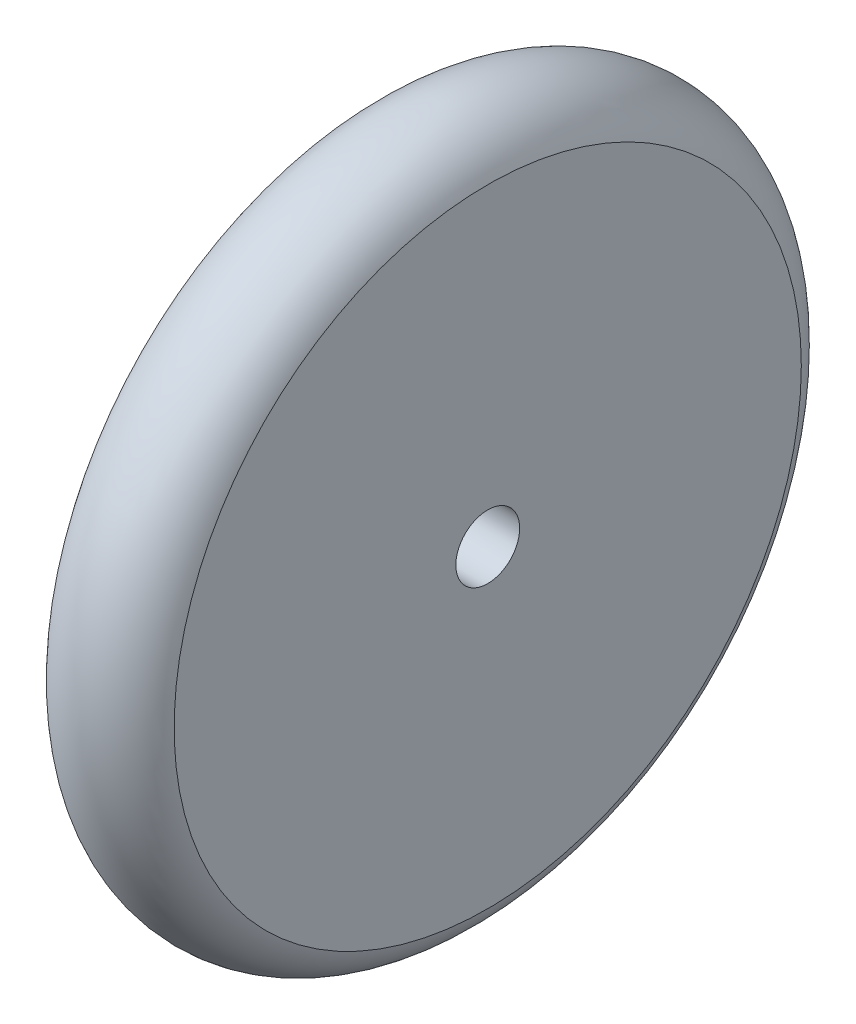
ISO-10303-21;
HEADER;
FILE_DESCRIPTION(('STEP AP214'),'2;1');
FILE_NAME('part.step','',(''),(''),'','','');
FILE_SCHEMA(('AUTOMOTIVE_DESIGN { 1 0 10303 214 1 1 1 1 }'));
ENDSEC;
DATA;
#1=APPLICATION_CONTEXT('core data for automotive mechanical design processes');
#2=APPLICATION_PROTOCOL_DEFINITION('international standard','automotive_design',2000,#1);
#3=PRODUCT_CONTEXT('',#1,'mechanical');
#4=PRODUCT('Part','Part','',(#3));
#5=PRODUCT_RELATED_PRODUCT_CATEGORY('part','',(#4));
#6=PRODUCT_DEFINITION_FORMATION('','',#4);
#7=PRODUCT_DEFINITION_CONTEXT('part definition',#1,'design');
#8=PRODUCT_DEFINITION('design','',#6,#7);
#9=PRODUCT_DEFINITION_SHAPE('','',#8);
#10=(LENGTH_UNIT() NAMED_UNIT(*) SI_UNIT(.MILLI.,.METRE.));
#11=(NAMED_UNIT(*) PLANE_ANGLE_UNIT() SI_UNIT($,.RADIAN.));
#12=(NAMED_UNIT(*) SI_UNIT($,.STERADIAN.) SOLID_ANGLE_UNIT());
#13=UNCERTAINTY_MEASURE_WITH_UNIT(LENGTH_MEASURE(1.E-05),#10,'distance_accuracy_value','');
#14=(GEOMETRIC_REPRESENTATION_CONTEXT(3) GLOBAL_UNCERTAINTY_ASSIGNED_CONTEXT((#13)) GLOBAL_UNIT_ASSIGNED_CONTEXT((#10,
#11,#12)) REPRESENTATION_CONTEXT('',''));
#15=CARTESIAN_POINT('',(0.,0.,0.));
#16=DIRECTION('',(0.,0.,1.));
#17=DIRECTION('',(1.,0.,0.));
#18=AXIS2_PLACEMENT_3D('',#15,#16,#17);
#19=CARTESIAN_POINT('',(7.5,4.,0.));
#20=DIRECTION('',(1.,0.,0.));
#21=DIRECTION('',(0.,0.,-1.));
#22=AXIS2_PLACEMENT_3D('',#19,#20,#21);
#23=PLANE('',#22);
#24=CARTESIAN_POINT('',(7.5,0.,0.));
#25=DIRECTION('',(1.,0.,0.));
#26=DIRECTION('',(0.,0.,-1.));
#27=AXIS2_PLACEMENT_3D('',#24,#25,#26);
#28=CIRCLE('',#27,39.2905841137543);
#29=CARTESIAN_POINT('',(7.5,0.,-39.2905841137543));
#30=VERTEX_POINT('',#29);
#31=EDGE_CURVE('E43',#30,#30,#28,.T.);
#32=ORIENTED_EDGE('',*,*,#31,.T.);
#33=EDGE_LOOP('',(#32));
#34=FACE_BOUND('',#33,.T.);
#35=CARTESIAN_POINT('',(7.5,0.,0.));
#36=DIRECTION('',(1.,0.,0.));
#37=DIRECTION('',(0.,0.,-1.));
#38=AXIS2_PLACEMENT_3D('',#35,#36,#37);
#39=CIRCLE('',#38,4.);
#40=CARTESIAN_POINT('',(7.5,0.,-4.));
#41=VERTEX_POINT('',#40);
#42=EDGE_CURVE('E10',#41,#41,#39,.T.);
#43=ORIENTED_EDGE('',*,*,#42,.F.);
#44=EDGE_LOOP('',(#43));
#45=FACE_BOUND('',#44,.T.);
#46=ADVANCED_FACE('F29',(#34,#45),#23,.T.);
#47=CARTESIAN_POINT('',(0.,0.,0.));
#48=DIRECTION('',(1.,0.,0.));
#49=DIRECTION('',(0.,0.,-1.));
#50=AXIS2_PLACEMENT_3D('',#47,#48,#49);
#51=CYLINDRICAL_SURFACE('',#50,4.);
#52=ORIENTED_EDGE('',*,*,#42,.T.);
#53=EDGE_LOOP('',(#52));
#54=FACE_BOUND('',#53,.T.);
#55=CARTESIAN_POINT('',(-7.5,0.,0.));
#56=DIRECTION('',(1.,0.,0.));
#57=DIRECTION('',(0.,0.,-1.));
#58=AXIS2_PLACEMENT_3D('',#55,#56,#57);
#59=CIRCLE('',#58,4.);
#60=CARTESIAN_POINT('',(-7.5,0.,-4.));
#61=VERTEX_POINT('',#60);
#62=EDGE_CURVE('E35',#61,#61,#59,.T.);
#63=ORIENTED_EDGE('',*,*,#62,.F.);
#64=EDGE_LOOP('',(#63));
#65=FACE_BOUND('',#64,.T.);
#66=ADVANCED_FACE('F59',(#54,#65),#51,.F.);
#67=CARTESIAN_POINT('',(-7.5,4.,0.));
#68=DIRECTION('',(-1.,0.,0.));
#69=DIRECTION('',(0.,0.,1.));
#70=AXIS2_PLACEMENT_3D('',#67,#68,#69);
#71=PLANE('',#70);
#72=ORIENTED_EDGE('',*,*,#62,.T.);
#73=EDGE_LOOP('',(#72));
#74=FACE_BOUND('',#73,.T.);
#75=CARTESIAN_POINT('',(-7.5,0.,0.));
#76=DIRECTION('',(1.,0.,0.));
#77=DIRECTION('',(0.,0.,-1.));
#78=AXIS2_PLACEMENT_3D('',#75,#76,#77);
#79=CIRCLE('',#78,39.2905841137543);
#80=CARTESIAN_POINT('',(-7.5,0.,-39.2905841137543));
#81=VERTEX_POINT('',#80);
#82=EDGE_CURVE('E39',#81,#81,#79,.T.);
#83=ORIENTED_EDGE('',*,*,#82,.F.);
#84=EDGE_LOOP('',(#83));
#85=FACE_BOUND('',#84,.T.);
#86=ADVANCED_FACE('F53',(#74,#85),#71,.T.);
#87=CARTESIAN_POINT('',(0.,0.,0.));
#88=DIRECTION('',(1.,0.,0.));
#89=DIRECTION('',(0.,0.,-1.));
#90=AXIS2_PLACEMENT_3D('',#87,#88,#89);
#91=TOROIDAL_SURFACE('',#90,36.4790771667847,8.0096548810082);
#92=ORIENTED_EDGE('',*,*,#82,.T.);
#93=EDGE_LOOP('',(#92));
#94=FACE_BOUND('',#93,.T.);
#95=ORIENTED_EDGE('',*,*,#31,.F.);
#96=EDGE_LOOP('',(#95));
#97=FACE_BOUND('',#96,.T.);
#98=ADVANCED_FACE('F51',(#94,#97),#91,.T.);
#99=CLOSED_SHELL('',(#46,#66,#86,#98));
#100=MANIFOLD_SOLID_BREP('B2',#99);
#101=ADVANCED_BREP_SHAPE_REPRESENTATION('',(#18,#100),#14);
#102=SHAPE_DEFINITION_REPRESENTATION(#9,#101);
ENDSEC;
END-ISO-10303-21;
